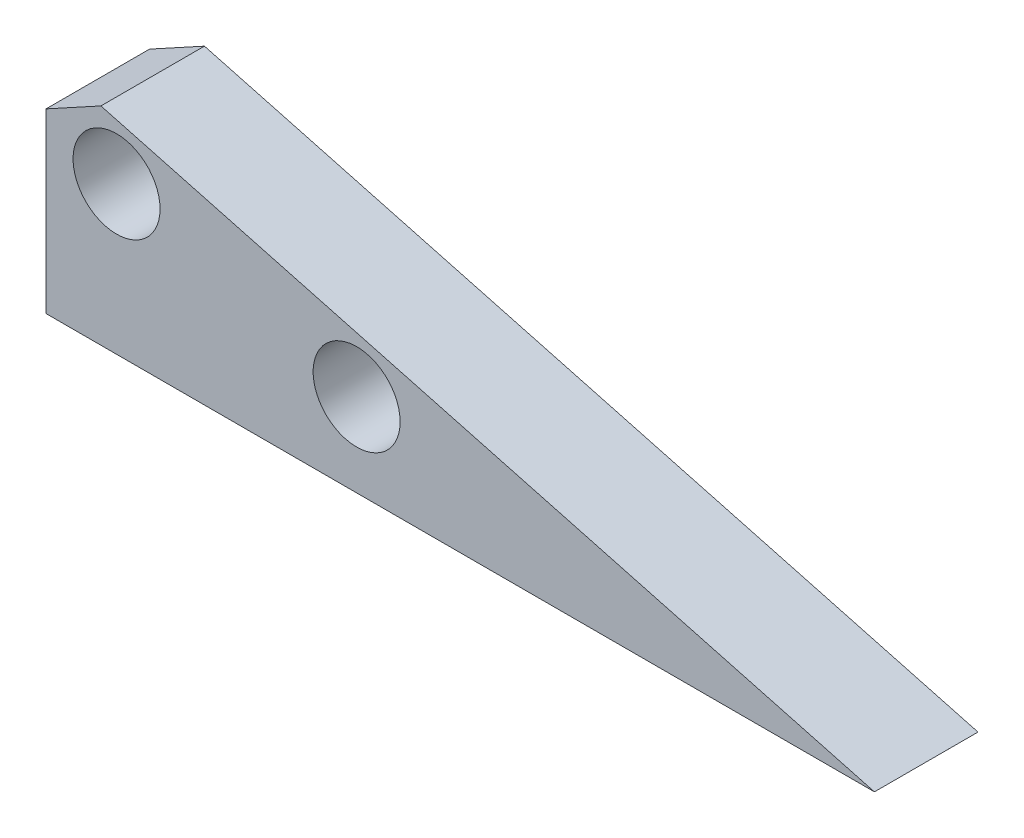
ISO-10303-21;
HEADER;
FILE_DESCRIPTION(('STEP AP214'),'2;1');
FILE_NAME('part.step','',(''),(''),'','','');
FILE_SCHEMA(('AUTOMOTIVE_DESIGN { 1 0 10303 214 1 1 1 1 }'));
ENDSEC;
DATA;
#1=APPLICATION_CONTEXT('core data for automotive mechanical design processes');
#2=APPLICATION_PROTOCOL_DEFINITION('international standard','automotive_design',2000,#1);
#3=PRODUCT_CONTEXT('',#1,'mechanical');
#4=PRODUCT('Part','Part','',(#3));
#5=PRODUCT_RELATED_PRODUCT_CATEGORY('part','',(#4));
#6=PRODUCT_DEFINITION_FORMATION('','',#4);
#7=PRODUCT_DEFINITION_CONTEXT('part definition',#1,'design');
#8=PRODUCT_DEFINITION('design','',#6,#7);
#9=PRODUCT_DEFINITION_SHAPE('','',#8);
#10=(LENGTH_UNIT() NAMED_UNIT(*) SI_UNIT(.MILLI.,.METRE.));
#11=(NAMED_UNIT(*) PLANE_ANGLE_UNIT() SI_UNIT($,.RADIAN.));
#12=(NAMED_UNIT(*) SI_UNIT($,.STERADIAN.) SOLID_ANGLE_UNIT());
#13=UNCERTAINTY_MEASURE_WITH_UNIT(LENGTH_MEASURE(1.E-05),#10,'distance_accuracy_value','');
#14=(GEOMETRIC_REPRESENTATION_CONTEXT(3) GLOBAL_UNCERTAINTY_ASSIGNED_CONTEXT((#13)) GLOBAL_UNIT_ASSIGNED_CONTEXT((#10,
#11,#12)) REPRESENTATION_CONTEXT('',''));
#15=CARTESIAN_POINT('',(0.,0.,0.));
#16=DIRECTION('',(0.,0.,1.));
#17=DIRECTION('',(1.,0.,0.));
#18=AXIS2_PLACEMENT_3D('',#15,#16,#17);
#19=CARTESIAN_POINT('',(-3.60219365011015,6.58891508339897,5.));
#20=DIRECTION('',(0.479697599569755,-0.877433879541368,0.));
#21=DIRECTION('',(0.877433879541368,0.479697599569755,0.));
#22=AXIS2_PLACEMENT_3D('',#19,#20,#21);
#23=PLANE('',#22);
#24=DIRECTION('',(-0.877433879541368,-0.479697599569755,0.));
#25=VECTOR('',#24,1.);
#26=CARTESIAN_POINT('',(-3.60219365011015,6.58891508339897,0.));
#27=LINE('',#26,#25);
#28=CARTESIAN_POINT('',(2.65108400272692,10.0076140297823,0.));
#29=VERTEX_POINT('',#28);
#30=CARTESIAN_POINT('',(0.,8.55825281634182,0.));
#31=VERTEX_POINT('',#30);
#32=EDGE_CURVE('E119',#29,#31,#27,.T.);
#33=ORIENTED_EDGE('',*,*,#32,.T.);
#34=DIRECTION('',(0.,0.,-1.));
#35=VECTOR('',#34,1.);
#36=CARTESIAN_POINT('',(0.,8.55825281634182,5.));
#37=LINE('',#36,#35);
#38=CARTESIAN_POINT('',(0.,8.55825281634182,5.));
#39=VERTEX_POINT('',#38);
#40=EDGE_CURVE('E11',#39,#31,#37,.T.);
#41=ORIENTED_EDGE('',*,*,#40,.F.);
#42=DIRECTION('',(-0.877433879541368,-0.479697599569755,0.));
#43=VECTOR('',#42,1.);
#44=CARTESIAN_POINT('',(-3.60219365011015,6.58891508339897,5.));
#45=LINE('',#44,#43);
#46=CARTESIAN_POINT('',(2.65108400272692,10.0076140297823,5.));
#47=VERTEX_POINT('',#46);
#48=EDGE_CURVE('E83',#47,#39,#45,.T.);
#49=ORIENTED_EDGE('',*,*,#48,.F.);
#50=DIRECTION('',(0.,0.,-1.));
#51=VECTOR('',#50,1.);
#52=CARTESIAN_POINT('',(2.65108400272692,10.0076140297823,5.));
#53=LINE('',#52,#51);
#54=EDGE_CURVE('E59',#47,#29,#53,.T.);
#55=ORIENTED_EDGE('',*,*,#54,.T.);
#56=EDGE_LOOP('',(#33,#41,#49,#55));
#57=FACE_BOUND('',#56,.T.);
#58=ADVANCED_FACE('F41',(#57),#23,.F.);
#59=CARTESIAN_POINT('',(0.,0.,5.));
#60=DIRECTION('',(-1.,0.,0.));
#61=DIRECTION('',(0.,0.,1.));
#62=AXIS2_PLACEMENT_3D('',#59,#60,#61);
#63=PLANE('',#62);
#64=DIRECTION('',(0.,1.,0.));
#65=VECTOR('',#64,1.);
#66=CARTESIAN_POINT('',(0.,0.,0.));
#67=LINE('',#66,#65);
#68=CARTESIAN_POINT('',(0.,0.,0.));
#69=VERTEX_POINT('',#68);
#70=EDGE_CURVE('E92',#69,#31,#67,.T.);
#71=ORIENTED_EDGE('',*,*,#70,.F.);
#72=DIRECTION('',(0.,0.,-1.));
#73=VECTOR('',#72,1.);
#74=CARTESIAN_POINT('',(0.,0.,5.));
#75=LINE('',#74,#73);
#76=CARTESIAN_POINT('',(0.,0.,5.));
#77=VERTEX_POINT('',#76);
#78=EDGE_CURVE('E51',#77,#69,#75,.T.);
#79=ORIENTED_EDGE('',*,*,#78,.F.);
#80=DIRECTION('',(0.,1.,0.));
#81=VECTOR('',#80,1.);
#82=CARTESIAN_POINT('',(0.,0.,5.));
#83=LINE('',#82,#81);
#84=EDGE_CURVE('E90',#77,#39,#83,.T.);
#85=ORIENTED_EDGE('',*,*,#84,.T.);
#86=ORIENTED_EDGE('',*,*,#40,.T.);
#87=EDGE_LOOP('',(#71,#79,#85,#86));
#88=FACE_BOUND('',#87,.T.);
#89=ADVANCED_FACE('F89',(#88),#63,.T.);
#90=CARTESIAN_POINT('',(0.,0.,5.));
#91=DIRECTION('',(0.,-1.,0.));
#92=DIRECTION('',(0.,0.,-1.));
#93=AXIS2_PLACEMENT_3D('',#90,#91,#92);
#94=PLANE('',#93);
#95=DIRECTION('',(-1.,0.,0.));
#96=VECTOR('',#95,1.);
#97=CARTESIAN_POINT('',(0.,0.,0.));
#98=LINE('',#97,#96);
#99=CARTESIAN_POINT('',(40.,0.,0.));
#100=VERTEX_POINT('',#99);
#101=EDGE_CURVE('E124',#100,#69,#98,.T.);
#102=ORIENTED_EDGE('',*,*,#101,.F.);
#103=DIRECTION('',(0.,0.,-1.));
#104=VECTOR('',#103,1.);
#105=CARTESIAN_POINT('',(40.,0.,5.));
#106=LINE('',#105,#104);
#107=CARTESIAN_POINT('',(40.,0.,5.));
#108=VERTEX_POINT('',#107);
#109=EDGE_CURVE('E72',#108,#100,#106,.T.);
#110=ORIENTED_EDGE('',*,*,#109,.F.);
#111=DIRECTION('',(-1.,0.,0.));
#112=VECTOR('',#111,1.);
#113=CARTESIAN_POINT('',(0.,0.,5.));
#114=LINE('',#113,#112);
#115=EDGE_CURVE('E100',#108,#77,#114,.T.);
#116=ORIENTED_EDGE('',*,*,#115,.T.);
#117=ORIENTED_EDGE('',*,*,#78,.T.);
#118=EDGE_LOOP('',(#102,#110,#116,#117));
#119=FACE_BOUND('',#118,.T.);
#120=ADVANCED_FACE('F103',(#119),#94,.T.);
#121=CARTESIAN_POINT('',(2.67949299856119,10.0000018606553,5.));
#122=DIRECTION('',(0.258819096984804,0.965925812387251,0.));
#123=DIRECTION('',(-0.965925812387251,0.258819096984804,0.));
#124=AXIS2_PLACEMENT_3D('',#121,#122,#123);
#125=PLANE('',#124);
#126=DIRECTION('',(0.965925812387251,-0.258819096984804,0.));
#127=VECTOR('',#126,1.);
#128=CARTESIAN_POINT('',(2.67949299856119,10.0000018606553,0.));
#129=LINE('',#128,#127);
#130=EDGE_CURVE('E127',#29,#100,#129,.T.);
#131=ORIENTED_EDGE('',*,*,#130,.F.);
#132=ORIENTED_EDGE('',*,*,#54,.F.);
#133=DIRECTION('',(0.965925812387251,-0.258819096984804,0.));
#134=VECTOR('',#133,1.);
#135=CARTESIAN_POINT('',(2.67949299856119,10.0000018606553,5.));
#136=LINE('',#135,#134);
#137=EDGE_CURVE('E105',#47,#108,#136,.T.);
#138=ORIENTED_EDGE('',*,*,#137,.T.);
#139=ORIENTED_EDGE('',*,*,#109,.T.);
#140=EDGE_LOOP('',(#131,#132,#138,#139));
#141=FACE_BOUND('',#140,.T.);
#142=ADVANCED_FACE('F169',(#141),#125,.T.);
#143=CARTESIAN_POINT('',(3.40688556657295,7.12453076003435,5.));
#144=DIRECTION('',(0.,0.,-1.));
#145=DIRECTION('',(-1.,0.,0.));
#146=AXIS2_PLACEMENT_3D('',#143,#144,#145);
#147=CYLINDRICAL_SURFACE('',#146,2.1);
#148=CARTESIAN_POINT('',(3.40688556657295,7.12453076003435,5.));
#149=DIRECTION('',(0.,0.,1.));
#150=DIRECTION('',(1.,0.,0.));
#151=AXIS2_PLACEMENT_3D('',#148,#149,#150);
#152=CIRCLE('',#151,2.1);
#153=CARTESIAN_POINT('',(5.50688556657295,7.12453076003435,5.));
#154=VERTEX_POINT('',#153);
#155=EDGE_CURVE('E135',#154,#154,#152,.T.);
#156=ORIENTED_EDGE('',*,*,#155,.T.);
#157=EDGE_LOOP('',(#156));
#158=FACE_BOUND('',#157,.T.);
#159=CARTESIAN_POINT('',(3.40688556657295,7.12453076003435,0.));
#160=DIRECTION('',(0.,0.,1.));
#161=DIRECTION('',(1.,0.,0.));
#162=AXIS2_PLACEMENT_3D('',#159,#160,#161);
#163=CIRCLE('',#162,2.1);
#164=CARTESIAN_POINT('',(5.50688556657295,7.12453076003435,0.));
#165=VERTEX_POINT('',#164);
#166=EDGE_CURVE('E115',#165,#165,#163,.T.);
#167=ORIENTED_EDGE('',*,*,#166,.F.);
#168=EDGE_LOOP('',(#167));
#169=FACE_BOUND('',#168,.T.);
#170=ADVANCED_FACE('F43',(#158,#169),#147,.F.);
#171=CARTESIAN_POINT('',(14.99799531522,4.0187015962167,5.));
#172=DIRECTION('',(0.,0.,-1.));
#173=DIRECTION('',(-1.,0.,0.));
#174=AXIS2_PLACEMENT_3D('',#171,#172,#173);
#175=CYLINDRICAL_SURFACE('',#174,2.1);
#176=CARTESIAN_POINT('',(14.99799531522,4.0187015962167,5.));
#177=DIRECTION('',(0.,0.,1.));
#178=DIRECTION('',(1.,0.,0.));
#179=AXIS2_PLACEMENT_3D('',#176,#177,#178);
#180=CIRCLE('',#179,2.1);
#181=CARTESIAN_POINT('',(17.09799531522,4.0187015962167,5.));
#182=VERTEX_POINT('',#181);
#183=EDGE_CURVE('E108',#182,#182,#180,.T.);
#184=ORIENTED_EDGE('',*,*,#183,.T.);
#185=EDGE_LOOP('',(#184));
#186=FACE_BOUND('',#185,.T.);
#187=CARTESIAN_POINT('',(14.99799531522,4.0187015962167,0.));
#188=DIRECTION('',(0.,0.,1.));
#189=DIRECTION('',(1.,0.,0.));
#190=AXIS2_PLACEMENT_3D('',#187,#188,#189);
#191=CIRCLE('',#190,2.1);
#192=CARTESIAN_POINT('',(17.09799531522,4.0187015962167,0.));
#193=VERTEX_POINT('',#192);
#194=EDGE_CURVE('E131',#193,#193,#191,.T.);
#195=ORIENTED_EDGE('',*,*,#194,.F.);
#196=EDGE_LOOP('',(#195));
#197=FACE_BOUND('',#196,.T.);
#198=ADVANCED_FACE('F151',(#186,#197),#175,.F.);
#199=CARTESIAN_POINT('',(0.,0.,5.));
#200=DIRECTION('',(0.,0.,1.));
#201=DIRECTION('',(1.,0.,0.));
#202=AXIS2_PLACEMENT_3D('',#199,#200,#201);
#203=PLANE('',#202);
#204=ORIENTED_EDGE('',*,*,#155,.F.);
#205=EDGE_LOOP('',(#204));
#206=FACE_BOUND('',#205,.T.);
#207=ORIENTED_EDGE('',*,*,#48,.T.);
#208=ORIENTED_EDGE('',*,*,#84,.F.);
#209=ORIENTED_EDGE('',*,*,#115,.F.);
#210=ORIENTED_EDGE('',*,*,#137,.F.);
#211=EDGE_LOOP('',(#207,#208,#209,#210));
#212=FACE_BOUND('',#211,.T.);
#213=ORIENTED_EDGE('',*,*,#183,.F.);
#214=EDGE_LOOP('',(#213));
#215=FACE_BOUND('',#214,.T.);
#216=ADVANCED_FACE('F98',(#206,#212,#215),#203,.T.);
#217=CARTESIAN_POINT('',(0.,0.,0.));
#218=DIRECTION('',(0.,0.,1.));
#219=DIRECTION('',(1.,0.,0.));
#220=AXIS2_PLACEMENT_3D('',#217,#218,#219);
#221=PLANE('',#220);
#222=ORIENTED_EDGE('',*,*,#166,.T.);
#223=EDGE_LOOP('',(#222));
#224=FACE_BOUND('',#223,.T.);
#225=ORIENTED_EDGE('',*,*,#32,.F.);
#226=ORIENTED_EDGE('',*,*,#130,.T.);
#227=ORIENTED_EDGE('',*,*,#101,.T.);
#228=ORIENTED_EDGE('',*,*,#70,.T.);
#229=EDGE_LOOP('',(#225,#226,#227,#228));
#230=FACE_BOUND('',#229,.T.);
#231=ORIENTED_EDGE('',*,*,#194,.T.);
#232=EDGE_LOOP('',(#231));
#233=FACE_BOUND('',#232,.T.);
#234=ADVANCED_FACE('F150',(#224,#230,#233),#221,.F.);
#235=CLOSED_SHELL('',(#58,#89,#120,#142,#170,#198,#216,#234));
#236=MANIFOLD_SOLID_BREP('B2',#235);
#237=ADVANCED_BREP_SHAPE_REPRESENTATION('',(#18,#236),#14);
#238=SHAPE_DEFINITION_REPRESENTATION(#9,#237);
ENDSEC;
END-ISO-10303-21;
